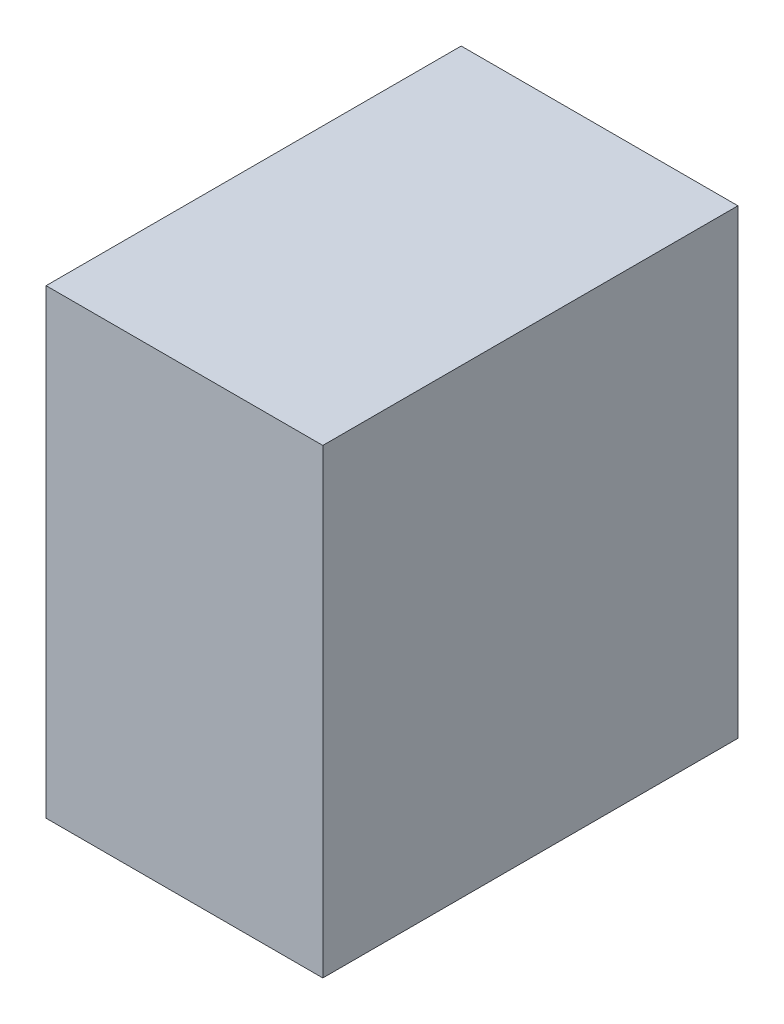
ISO-10303-21;
HEADER;
FILE_DESCRIPTION(('STEP AP214'),'2;1');
FILE_NAME('part.step','',(''),(''),'','','');
FILE_SCHEMA(('AUTOMOTIVE_DESIGN { 1 0 10303 214 1 1 1 1 }'));
ENDSEC;
DATA;
#1=APPLICATION_CONTEXT('core data for automotive mechanical design processes');
#2=APPLICATION_PROTOCOL_DEFINITION('international standard','automotive_design',2000,#1);
#3=PRODUCT_CONTEXT('',#1,'mechanical');
#4=PRODUCT('Part','Part','',(#3));
#5=PRODUCT_RELATED_PRODUCT_CATEGORY('part','',(#4));
#6=PRODUCT_DEFINITION_FORMATION('','',#4);
#7=PRODUCT_DEFINITION_CONTEXT('part definition',#1,'design');
#8=PRODUCT_DEFINITION('design','',#6,#7);
#9=PRODUCT_DEFINITION_SHAPE('','',#8);
#10=(LENGTH_UNIT() NAMED_UNIT(*) SI_UNIT(.MILLI.,.METRE.));
#11=(NAMED_UNIT(*) PLANE_ANGLE_UNIT() SI_UNIT($,.RADIAN.));
#12=(NAMED_UNIT(*) SI_UNIT($,.STERADIAN.) SOLID_ANGLE_UNIT());
#13=UNCERTAINTY_MEASURE_WITH_UNIT(LENGTH_MEASURE(1.E-05),#10,'distance_accuracy_value','');
#14=(GEOMETRIC_REPRESENTATION_CONTEXT(3) GLOBAL_UNCERTAINTY_ASSIGNED_CONTEXT((#13)) GLOBAL_UNIT_ASSIGNED_CONTEXT((#10,
#11,#12)) REPRESENTATION_CONTEXT('',''));
#15=CARTESIAN_POINT('',(0.,0.,0.));
#16=DIRECTION('',(0.,0.,1.));
#17=DIRECTION('',(1.,0.,0.));
#18=AXIS2_PLACEMENT_3D('',#15,#16,#17);
#19=CARTESIAN_POINT('',(3.3,0.699999785812197,-3.30112145980015));
#20=DIRECTION('',(1.,0.,0.));
#21=DIRECTION('',(0.,1.,8.74227765734759E-08));
#22=AXIS2_PLACEMENT_3D('',#19,#20,#21);
#23=PLANE('',#22);
#24=DIRECTION('',(0.,-0.999999999999996,-8.74227765733007E-08));
#25=VECTOR('',#24,1.);
#26=CARTESIAN_POINT('',(3.3,1.74999970276256,-2.35112136800623));
#27=LINE('',#26,#25);
#28=CARTESIAN_POINT('',(3.300000000001,1.74999970276156,-2.35112136800623));
#29=VERTEX_POINT('',#28);
#30=CARTESIAN_POINT('',(3.300000000001,0.74999970276056,-2.35112145543001));
#31=VERTEX_POINT('',#30);
#32=EDGE_CURVE('E11',#29,#31,#27,.T.);
#33=ORIENTED_EDGE('',*,*,#32,.F.);
#34=DIRECTION('',(0.,-8.7422776672162E-08,0.999999999999996));
#35=VECTOR('',#34,1.);
#36=CARTESIAN_POINT('',(3.3,1.74999978144306,-3.25112136800623));
#37=LINE('',#36,#35);
#38=CARTESIAN_POINT('',(3.300000000001,1.74999978144306,-3.25112136800523));
#39=VERTEX_POINT('',#38);
#40=EDGE_CURVE('E59',#39,#29,#37,.T.);
#41=ORIENTED_EDGE('',*,*,#40,.F.);
#42=DIRECTION('',(0.,0.999999999999996,8.74227765733007E-08));
#43=VECTOR('',#42,1.);
#44=CARTESIAN_POINT('',(3.3,0.749999781441059,-3.25112145542901));
#45=LINE('',#44,#43);
#46=CARTESIAN_POINT('',(3.300000000001,0.749999781442059,-3.25112145542901));
#47=VERTEX_POINT('',#46);
#48=EDGE_CURVE('E79',#47,#39,#45,.T.);
#49=ORIENTED_EDGE('',*,*,#48,.F.);
#50=DIRECTION('',(0.,8.74227765488039E-08,-0.999999999999996));
#51=VECTOR('',#50,1.);
#52=CARTESIAN_POINT('',(3.3,0.74999970276056,-2.35112145542901));
#53=LINE('',#52,#51);
#54=EDGE_CURVE('E84',#31,#47,#53,.T.);
#55=ORIENTED_EDGE('',*,*,#54,.F.);
#56=EDGE_LOOP('',(#33,#41,#49,#55));
#57=FACE_BOUND('',#56,.T.);
#58=ADVANCED_FACE('F17',(#57),#23,.F.);
#59=CARTESIAN_POINT('',(3.9,0.699999785812197,-3.30112145980015));
#60=DIRECTION('',(1.,0.,0.));
#61=DIRECTION('',(0.,1.,8.74227765734759E-08));
#62=AXIS2_PLACEMENT_3D('',#59,#60,#61);
#63=PLANE('',#62);
#64=DIRECTION('',(0.,8.7422776672162E-08,-0.999999999999996));
#65=VECTOR('',#64,1.);
#66=CARTESIAN_POINT('',(3.9,0.749999702760559,-2.35112145542901));
#67=LINE('',#66,#65);
#68=CARTESIAN_POINT('',(3.899999999999,0.74999970276056,-2.35112145543001));
#69=VERTEX_POINT('',#68);
#70=CARTESIAN_POINT('',(3.899999999999,0.749999781442059,-3.25112145542901));
#71=VERTEX_POINT('',#70);
#72=EDGE_CURVE('E24',#69,#71,#67,.T.);
#73=ORIENTED_EDGE('',*,*,#72,.T.);
#74=DIRECTION('',(0.,0.999999999999996,8.74227765733007E-08));
#75=VECTOR('',#74,1.);
#76=CARTESIAN_POINT('',(3.9,0.749999781441059,-3.25112145542901));
#77=LINE('',#76,#75);
#78=CARTESIAN_POINT('',(3.899999999999,1.74999978144306,-3.25112136800523));
#79=VERTEX_POINT('',#78);
#80=EDGE_CURVE('E82',#71,#79,#77,.T.);
#81=ORIENTED_EDGE('',*,*,#80,.T.);
#82=DIRECTION('',(0.,-8.7422776672162E-08,0.999999999999996));
#83=VECTOR('',#82,1.);
#84=CARTESIAN_POINT('',(3.9,1.74999978144306,-3.25112136800623));
#85=LINE('',#84,#83);
#86=CARTESIAN_POINT('',(3.899999999999,1.74999970276156,-2.35112136800623));
#87=VERTEX_POINT('',#86);
#88=EDGE_CURVE('E64',#79,#87,#85,.T.);
#89=ORIENTED_EDGE('',*,*,#88,.T.);
#90=DIRECTION('',(0.,-0.999999999999996,-8.74227765733006E-08));
#91=VECTOR('',#90,1.);
#92=CARTESIAN_POINT('',(3.9,1.74999970276256,-2.35112136800624));
#93=LINE('',#92,#91);
#94=EDGE_CURVE('E61',#87,#69,#93,.T.);
#95=ORIENTED_EDGE('',*,*,#94,.T.);
#96=EDGE_LOOP('',(#73,#81,#89,#95));
#97=FACE_BOUND('',#96,.T.);
#98=ADVANCED_FACE('F62',(#97),#63,.T.);
#99=CARTESIAN_POINT('',(3.3,0.74999970276056,-2.35112145542901));
#100=DIRECTION('',(0.,-1.,-8.74227765734759E-08));
#101=DIRECTION('',(0.,8.74227765734759E-08,-1.));
#102=AXIS2_PLACEMENT_3D('',#99,#100,#101);
#103=PLANE('',#102);
#104=ORIENTED_EDGE('',*,*,#54,.T.);
#105=DIRECTION('',(1.,0.,0.));
#106=VECTOR('',#105,1.);
#107=CARTESIAN_POINT('',(3.3,0.749999781441059,-3.25112145542901));
#108=LINE('',#107,#106);
#109=EDGE_CURVE('E57',#47,#71,#108,.T.);
#110=ORIENTED_EDGE('',*,*,#109,.T.);
#111=ORIENTED_EDGE('',*,*,#72,.F.);
#112=DIRECTION('',(1.,0.,0.));
#113=VECTOR('',#112,1.);
#114=CARTESIAN_POINT('',(3.3,0.749999702760559,-2.35112145542901));
#115=LINE('',#114,#113);
#116=EDGE_CURVE('E55',#31,#69,#115,.T.);
#117=ORIENTED_EDGE('',*,*,#116,.F.);
#118=EDGE_LOOP('',(#104,#110,#111,#117));
#119=FACE_BOUND('',#118,.T.);
#120=ADVANCED_FACE('F53',(#119),#103,.T.);
#121=CARTESIAN_POINT('',(3.3,0.749999781441059,-3.25112145542901));
#122=DIRECTION('',(0.,8.74227765734759E-08,-1.));
#123=DIRECTION('',(0.,1.,8.74227765734759E-08));
#124=AXIS2_PLACEMENT_3D('',#121,#122,#123);
#125=PLANE('',#124);
#126=ORIENTED_EDGE('',*,*,#48,.T.);
#127=DIRECTION('',(1.,0.,0.));
#128=VECTOR('',#127,1.);
#129=CARTESIAN_POINT('',(3.3,1.74999978144306,-3.25112136800623));
#130=LINE('',#129,#128);
#131=EDGE_CURVE('E68',#39,#79,#130,.T.);
#132=ORIENTED_EDGE('',*,*,#131,.T.);
#133=ORIENTED_EDGE('',*,*,#80,.F.);
#134=ORIENTED_EDGE('',*,*,#109,.F.);
#135=EDGE_LOOP('',(#126,#132,#133,#134));
#136=FACE_BOUND('',#135,.T.);
#137=ADVANCED_FACE('F91',(#136),#125,.T.);
#138=CARTESIAN_POINT('',(3.3,1.74999978144306,-3.25112136800623));
#139=DIRECTION('',(0.,1.,8.74227765734759E-08));
#140=DIRECTION('',(0.,-8.74227765734759E-08,1.));
#141=AXIS2_PLACEMENT_3D('',#138,#139,#140);
#142=PLANE('',#141);
#143=ORIENTED_EDGE('',*,*,#40,.T.);
#144=DIRECTION('',(1.,0.,0.));
#145=VECTOR('',#144,1.);
#146=CARTESIAN_POINT('',(3.3,1.74999970276256,-2.35112136800623));
#147=LINE('',#146,#145);
#148=EDGE_CURVE('E69',#29,#87,#147,.T.);
#149=ORIENTED_EDGE('',*,*,#148,.T.);
#150=ORIENTED_EDGE('',*,*,#88,.F.);
#151=ORIENTED_EDGE('',*,*,#131,.F.);
#152=EDGE_LOOP('',(#143,#149,#150,#151));
#153=FACE_BOUND('',#152,.T.);
#154=ADVANCED_FACE('F88',(#153),#142,.T.);
#155=CARTESIAN_POINT('',(3.3,1.74999970276256,-2.35112136800623));
#156=DIRECTION('',(0.,-8.74227765734759E-08,1.));
#157=DIRECTION('',(0.,-1.,-8.74227765734759E-08));
#158=AXIS2_PLACEMENT_3D('',#155,#156,#157);
#159=PLANE('',#158);
#160=ORIENTED_EDGE('',*,*,#32,.T.);
#161=ORIENTED_EDGE('',*,*,#116,.T.);
#162=ORIENTED_EDGE('',*,*,#94,.F.);
#163=ORIENTED_EDGE('',*,*,#148,.F.);
#164=EDGE_LOOP('',(#160,#161,#162,#163));
#165=FACE_BOUND('',#164,.T.);
#166=ADVANCED_FACE('F71',(#165),#159,.T.);
#167=CLOSED_SHELL('',(#58,#98,#120,#137,#154,#166));
#168=MANIFOLD_SOLID_BREP('B1',#167);
#169=ADVANCED_BREP_SHAPE_REPRESENTATION('',(#18,#168),#14);
#170=SHAPE_DEFINITION_REPRESENTATION(#9,#169);
ENDSEC;
END-ISO-10303-21;
